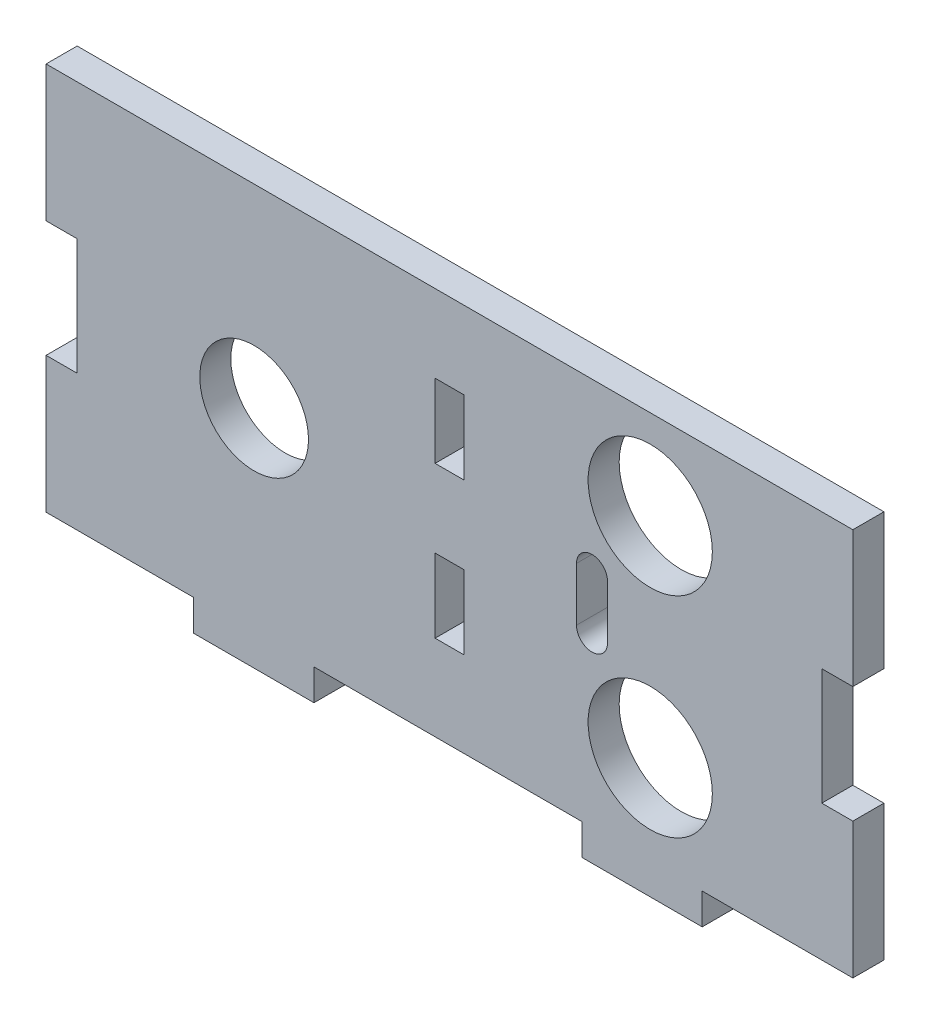
ISO-10303-21;
HEADER;
FILE_DESCRIPTION(('STEP AP214'),'2;1');
FILE_NAME('part.step','',(''),(''),'','','');
FILE_SCHEMA(('AUTOMOTIVE_DESIGN { 1 0 10303 214 1 1 1 1 }'));
ENDSEC;
DATA;
#1=APPLICATION_CONTEXT('core data for automotive mechanical design processes');
#2=APPLICATION_PROTOCOL_DEFINITION('international standard','automotive_design',2000,#1);
#3=PRODUCT_CONTEXT('',#1,'mechanical');
#4=PRODUCT('Part','Part','',(#3));
#5=PRODUCT_RELATED_PRODUCT_CATEGORY('part','',(#4));
#6=PRODUCT_DEFINITION_FORMATION('','',#4);
#7=PRODUCT_DEFINITION_CONTEXT('part definition',#1,'design');
#8=PRODUCT_DEFINITION('design','',#6,#7);
#9=PRODUCT_DEFINITION_SHAPE('','',#8);
#10=(LENGTH_UNIT() NAMED_UNIT(*) SI_UNIT(.MILLI.,.METRE.));
#11=(NAMED_UNIT(*) PLANE_ANGLE_UNIT() SI_UNIT($,.RADIAN.));
#12=(NAMED_UNIT(*) SI_UNIT($,.STERADIAN.) SOLID_ANGLE_UNIT());
#13=UNCERTAINTY_MEASURE_WITH_UNIT(LENGTH_MEASURE(1.E-05),#10,'distance_accuracy_value','');
#14=(GEOMETRIC_REPRESENTATION_CONTEXT(3) GLOBAL_UNCERTAINTY_ASSIGNED_CONTEXT((#13)) GLOBAL_UNIT_ASSIGNED_CONTEXT((#10,
#11,#12)) REPRESENTATION_CONTEXT('',''));
#15=CARTESIAN_POINT('',(0.,0.,0.));
#16=DIRECTION('',(0.,0.,1.));
#17=DIRECTION('',(1.,0.,0.));
#18=AXIS2_PLACEMENT_3D('',#15,#16,#17);
#19=CARTESIAN_POINT('',(0.,0.,4.));
#20=DIRECTION('',(0.,1.,0.));
#21=DIRECTION('',(0.,0.,1.));
#22=AXIS2_PLACEMENT_3D('',#19,#20,#21);
#23=PLANE('',#22);
#24=DIRECTION('',(0.,0.,1.));
#25=VECTOR('',#24,1.);
#26=CARTESIAN_POINT('',(151.95,0.,-0.00100000000000013));
#27=LINE('',#26,#25);
#28=CARTESIAN_POINT('',(151.95,0.,0.));
#29=VERTEX_POINT('',#28);
#30=CARTESIAN_POINT('',(151.95,0.,4.));
#31=VERTEX_POINT('',#30);
#32=EDGE_CURVE('E293',#29,#31,#27,.T.);
#33=ORIENTED_EDGE('',*,*,#32,.T.);
#34=DIRECTION('',(1.,0.,0.));
#35=VECTOR('',#34,1.);
#36=CARTESIAN_POINT('',(0.,0.,4.));
#37=LINE('',#36,#35);
#38=CARTESIAN_POINT('',(132.55,0.,4.));
#39=VERTEX_POINT('',#38);
#40=EDGE_CURVE('E493',#39,#31,#37,.T.);
#41=ORIENTED_EDGE('',*,*,#40,.F.);
#42=DIRECTION('',(0.,0.,1.));
#43=VECTOR('',#42,1.);
#44=CARTESIAN_POINT('',(132.55,0.,0.));
#45=LINE('',#44,#43);
#46=CARTESIAN_POINT('',(132.55,0.,0.));
#47=VERTEX_POINT('',#46);
#48=EDGE_CURVE('E473',#47,#39,#45,.T.);
#49=ORIENTED_EDGE('',*,*,#48,.F.);
#50=DIRECTION('',(1.,0.,0.));
#51=VECTOR('',#50,1.);
#52=CARTESIAN_POINT('',(0.,0.,0.));
#53=LINE('',#52,#51);
#54=EDGE_CURVE('E491',#47,#29,#53,.T.);
#55=ORIENTED_EDGE('',*,*,#54,.T.);
#56=EDGE_LOOP('',(#33,#41,#49,#55));
#57=FACE_BOUND('',#56,.T.);
#58=ADVANCED_FACE('F33',(#57),#23,.F.);
#59=CARTESIAN_POINT('',(0.,50.,4.));
#60=DIRECTION('',(0.,-1.,0.));
#61=DIRECTION('',(0.,0.,-1.));
#62=AXIS2_PLACEMENT_3D('',#59,#60,#61);
#63=PLANE('',#62);
#64=DIRECTION('',(0.,0.,-1.));
#65=VECTOR('',#64,1.);
#66=CARTESIAN_POINT('',(151.95,50.,-0.00100000000000013));
#67=LINE('',#66,#65);
#68=CARTESIAN_POINT('',(151.95,50.,4.));
#69=VERTEX_POINT('',#68);
#70=CARTESIAN_POINT('',(151.95,50.,0.));
#71=VERTEX_POINT('',#70);
#72=EDGE_CURVE('E286',#69,#71,#67,.T.);
#73=ORIENTED_EDGE('',*,*,#72,.T.);
#74=DIRECTION('',(-1.,0.,0.));
#75=VECTOR('',#74,1.);
#76=CARTESIAN_POINT('',(0.,50.,0.));
#77=LINE('',#76,#75);
#78=CARTESIAN_POINT('',(48.05,50.,0.));
#79=VERTEX_POINT('',#78);
#80=EDGE_CURVE('E36',#71,#79,#77,.T.);
#81=ORIENTED_EDGE('',*,*,#80,.T.);
#82=DIRECTION('',(0.,0.,-1.));
#83=VECTOR('',#82,1.);
#84=CARTESIAN_POINT('',(48.05,50.,-0.00100000000000013));
#85=LINE('',#84,#83);
#86=CARTESIAN_POINT('',(48.05,50.,4.));
#87=VERTEX_POINT('',#86);
#88=EDGE_CURVE('E330',#87,#79,#85,.T.);
#89=ORIENTED_EDGE('',*,*,#88,.F.);
#90=DIRECTION('',(-1.,0.,0.));
#91=VECTOR('',#90,1.);
#92=CARTESIAN_POINT('',(0.,50.,4.));
#93=LINE('',#92,#91);
#94=EDGE_CURVE('E11',#69,#87,#93,.T.);
#95=ORIENTED_EDGE('',*,*,#94,.F.);
#96=EDGE_LOOP('',(#73,#81,#89,#95));
#97=FACE_BOUND('',#96,.T.);
#98=ADVANCED_FACE('F544',(#97),#63,.F.);
#99=CARTESIAN_POINT('',(0.,0.,4.));
#100=DIRECTION('',(0.,0.,-1.));
#101=DIRECTION('',(-1.,0.,0.));
#102=AXIS2_PLACEMENT_3D('',#99,#100,#101);
#103=PLANE('',#102);
#104=CARTESIAN_POINT('',(74.842197301848,25.,4.));
#105=DIRECTION('',(0.,0.,1.));
#106=DIRECTION('',(1.,0.,0.));
#107=AXIS2_PLACEMENT_3D('',#104,#105,#106);
#108=CIRCLE('',#107,7.);
#109=CARTESIAN_POINT('',(81.842197301848,25.,4.));
#110=VERTEX_POINT('',#109);
#111=EDGE_CURVE('E277',#110,#110,#108,.T.);
#112=ORIENTED_EDGE('',*,*,#111,.F.);
#113=EDGE_LOOP('',(#112));
#114=FACE_BOUND('',#113,.T.);
#115=DIRECTION('',(0.,-1.,0.));
#116=VECTOR('',#115,1.);
#117=CARTESIAN_POINT('',(116.354935265181,28.4489639727675,4.));
#118=LINE('',#117,#116);
#119=CARTESIAN_POINT('',(116.354935265181,28.4489639727675,4.));
#120=VERTEX_POINT('',#119);
#121=CARTESIAN_POINT('',(116.354935265181,21.5510360272325,4.));
#122=VERTEX_POINT('',#121);
#123=EDGE_CURVE('E261',#120,#122,#118,.T.);
#124=ORIENTED_EDGE('',*,*,#123,.F.);
#125=CARTESIAN_POINT('',(118.354935265181,28.4489639727675,4.));
#126=DIRECTION('',(0.,0.,1.));
#127=DIRECTION('',(1.,0.,0.));
#128=AXIS2_PLACEMENT_3D('',#125,#126,#127);
#129=CIRCLE('',#128,2.00000000000002);
#130=CARTESIAN_POINT('',(120.354935265181,28.4489639727675,4.));
#131=VERTEX_POINT('',#130);
#132=EDGE_CURVE('E49',#131,#120,#129,.T.);
#133=ORIENTED_EDGE('',*,*,#132,.F.);
#134=DIRECTION('',(0.,1.,0.));
#135=VECTOR('',#134,1.);
#136=CARTESIAN_POINT('',(120.354935265181,28.4489639727675,4.));
#137=LINE('',#136,#135);
#138=CARTESIAN_POINT('',(120.354935265181,21.5510360272325,4.));
#139=VERTEX_POINT('',#138);
#140=EDGE_CURVE('E254',#139,#131,#137,.T.);
#141=ORIENTED_EDGE('',*,*,#140,.F.);
#142=CARTESIAN_POINT('',(118.354935265181,21.5510360272325,4.));
#143=DIRECTION('',(0.,0.,1.));
#144=DIRECTION('',(1.,0.,0.));
#145=AXIS2_PLACEMENT_3D('',#142,#143,#144);
#146=CIRCLE('',#145,2.00000000000002);
#147=EDGE_CURVE('E268',#122,#139,#146,.T.);
#148=ORIENTED_EDGE('',*,*,#147,.F.);
#149=EDGE_LOOP('',(#124,#133,#141,#148));
#150=FACE_BOUND('',#149,.T.);
#151=CARTESIAN_POINT('',(125.855537029281,38.5,4.));
#152=DIRECTION('',(0.,0.,1.));
#153=DIRECTION('',(1.,0.,0.));
#154=AXIS2_PLACEMENT_3D('',#151,#152,#153);
#155=CIRCLE('',#154,8.00000000000001);
#156=CARTESIAN_POINT('',(133.855537029281,38.5,4.));
#157=VERTEX_POINT('',#156);
#158=EDGE_CURVE('E290',#157,#157,#155,.T.);
#159=ORIENTED_EDGE('',*,*,#158,.F.);
#160=EDGE_LOOP('',(#159));
#161=FACE_BOUND('',#160,.T.);
#162=CARTESIAN_POINT('',(125.855537029281,11.5,4.));
#163=DIRECTION('',(0.,0.,1.));
#164=DIRECTION('',(1.,0.,0.));
#165=AXIS2_PLACEMENT_3D('',#162,#163,#164);
#166=CIRCLE('',#165,8.00000000000001);
#167=CARTESIAN_POINT('',(133.855537029281,11.5,4.));
#168=VERTEX_POINT('',#167);
#169=EDGE_CURVE('E283',#168,#168,#166,.T.);
#170=ORIENTED_EDGE('',*,*,#169,.F.);
#171=EDGE_LOOP('',(#170));
#172=FACE_BOUND('',#171,.T.);
#173=DIRECTION('',(-1.,0.,0.));
#174=VECTOR('',#173,1.);
#175=CARTESIAN_POINT('',(101.85,20.5,4.));
#176=LINE('',#175,#174);
#177=CARTESIAN_POINT('',(101.85,20.5,4.));
#178=VERTEX_POINT('',#177);
#179=CARTESIAN_POINT('',(98.15,20.5,4.));
#180=VERTEX_POINT('',#179);
#181=EDGE_CURVE('E408',#178,#180,#176,.T.);
#182=ORIENTED_EDGE('',*,*,#181,.F.);
#183=DIRECTION('',(0.,1.,0.));
#184=VECTOR('',#183,1.);
#185=CARTESIAN_POINT('',(101.85,20.5,4.));
#186=LINE('',#185,#184);
#187=CARTESIAN_POINT('',(101.85,11.,4.));
#188=VERTEX_POINT('',#187);
#189=EDGE_CURVE('E411',#188,#178,#186,.T.);
#190=ORIENTED_EDGE('',*,*,#189,.F.);
#191=DIRECTION('',(1.,0.,0.));
#192=VECTOR('',#191,1.);
#193=CARTESIAN_POINT('',(101.85,11.,4.));
#194=LINE('',#193,#192);
#195=CARTESIAN_POINT('',(98.15,11.,4.));
#196=VERTEX_POINT('',#195);
#197=EDGE_CURVE('E377',#196,#188,#194,.T.);
#198=ORIENTED_EDGE('',*,*,#197,.F.);
#199=DIRECTION('',(0.,-1.,0.));
#200=VECTOR('',#199,1.);
#201=CARTESIAN_POINT('',(98.15,20.5,4.));
#202=LINE('',#201,#200);
#203=EDGE_CURVE('E373',#180,#196,#202,.T.);
#204=ORIENTED_EDGE('',*,*,#203,.F.);
#205=EDGE_LOOP('',(#182,#190,#198,#204));
#206=FACE_BOUND('',#205,.T.);
#207=DIRECTION('',(0.,1.,0.));
#208=VECTOR('',#207,1.);
#209=CARTESIAN_POINT('',(101.85,40.,4.));
#210=LINE('',#209,#208);
#211=CARTESIAN_POINT('',(101.85,30.5,4.));
#212=VERTEX_POINT('',#211);
#213=CARTESIAN_POINT('',(101.85,40.,4.));
#214=VERTEX_POINT('',#213);
#215=EDGE_CURVE('E376',#212,#214,#210,.T.);
#216=ORIENTED_EDGE('',*,*,#215,.F.);
#217=DIRECTION('',(1.,0.,0.));
#218=VECTOR('',#217,1.);
#219=CARTESIAN_POINT('',(101.85,30.5,4.));
#220=LINE('',#219,#218);
#221=CARTESIAN_POINT('',(98.15,30.5,4.));
#222=VERTEX_POINT('',#221);
#223=EDGE_CURVE('E380',#222,#212,#220,.T.);
#224=ORIENTED_EDGE('',*,*,#223,.F.);
#225=DIRECTION('',(0.,-1.,0.));
#226=VECTOR('',#225,1.);
#227=CARTESIAN_POINT('',(98.15,30.5,4.));
#228=LINE('',#227,#226);
#229=CARTESIAN_POINT('',(98.15,40.,4.));
#230=VERTEX_POINT('',#229);
#231=EDGE_CURVE('E397',#230,#222,#228,.T.);
#232=ORIENTED_EDGE('',*,*,#231,.F.);
#233=DIRECTION('',(-1.,0.,0.));
#234=VECTOR('',#233,1.);
#235=CARTESIAN_POINT('',(98.15,40.,4.));
#236=LINE('',#235,#234);
#237=EDGE_CURVE('E374',#214,#230,#236,.T.);
#238=ORIENTED_EDGE('',*,*,#237,.F.);
#239=EDGE_LOOP('',(#216,#224,#232,#238));
#240=FACE_BOUND('',#239,.T.);
#241=DIRECTION('',(0.,1.,0.));
#242=VECTOR('',#241,1.);
#243=CARTESIAN_POINT('',(151.95,17.5,4.));
#244=LINE('',#243,#242);
#245=CARTESIAN_POINT('',(151.95,17.5,4.));
#246=VERTEX_POINT('',#245);
#247=EDGE_CURVE('E317',#31,#246,#244,.T.);
#248=ORIENTED_EDGE('',*,*,#247,.T.);
#249=DIRECTION('',(-1.,0.,0.));
#250=VECTOR('',#249,1.);
#251=CARTESIAN_POINT('',(151.95,17.5,4.));
#252=LINE('',#251,#250);
#253=CARTESIAN_POINT('',(147.95,17.5,4.));
#254=VERTEX_POINT('',#253);
#255=EDGE_CURVE('E314',#246,#254,#252,.T.);
#256=ORIENTED_EDGE('',*,*,#255,.T.);
#257=DIRECTION('',(0.,1.,0.));
#258=VECTOR('',#257,1.);
#259=CARTESIAN_POINT('',(147.95,17.5,4.));
#260=LINE('',#259,#258);
#261=CARTESIAN_POINT('',(147.95,32.5,4.));
#262=VERTEX_POINT('',#261);
#263=EDGE_CURVE('E311',#254,#262,#260,.T.);
#264=ORIENTED_EDGE('',*,*,#263,.T.);
#265=DIRECTION('',(1.,0.,0.));
#266=VECTOR('',#265,1.);
#267=CARTESIAN_POINT('',(147.95,32.5,4.));
#268=LINE('',#267,#266);
#269=CARTESIAN_POINT('',(151.95,32.5,4.));
#270=VERTEX_POINT('',#269);
#271=EDGE_CURVE('E308',#262,#270,#268,.T.);
#272=ORIENTED_EDGE('',*,*,#271,.T.);
#273=DIRECTION('',(0.,1.,0.));
#274=VECTOR('',#273,1.);
#275=CARTESIAN_POINT('',(151.95,32.5,4.));
#276=LINE('',#275,#274);
#277=EDGE_CURVE('E305',#270,#69,#276,.T.);
#278=ORIENTED_EDGE('',*,*,#277,.T.);
#279=ORIENTED_EDGE('',*,*,#94,.T.);
#280=DIRECTION('',(0.,1.,0.));
#281=VECTOR('',#280,1.);
#282=CARTESIAN_POINT('',(48.05,32.5,4.));
#283=LINE('',#282,#281);
#284=CARTESIAN_POINT('',(48.05,32.5,4.));
#285=VERTEX_POINT('',#284);
#286=EDGE_CURVE('E359',#285,#87,#283,.T.);
#287=ORIENTED_EDGE('',*,*,#286,.F.);
#288=DIRECTION('',(-1.,0.,0.));
#289=VECTOR('',#288,1.);
#290=CARTESIAN_POINT('',(52.05,32.5,4.));
#291=LINE('',#290,#289);
#292=CARTESIAN_POINT('',(52.05,32.5,4.));
#293=VERTEX_POINT('',#292);
#294=EDGE_CURVE('E356',#293,#285,#291,.T.);
#295=ORIENTED_EDGE('',*,*,#294,.F.);
#296=DIRECTION('',(0.,1.,0.));
#297=VECTOR('',#296,1.);
#298=CARTESIAN_POINT('',(52.05,17.5,4.));
#299=LINE('',#298,#297);
#300=CARTESIAN_POINT('',(52.05,17.5,4.));
#301=VERTEX_POINT('',#300);
#302=EDGE_CURVE('E353',#301,#293,#299,.T.);
#303=ORIENTED_EDGE('',*,*,#302,.F.);
#304=DIRECTION('',(1.,0.,0.));
#305=VECTOR('',#304,1.);
#306=CARTESIAN_POINT('',(48.05,17.5,4.));
#307=LINE('',#306,#305);
#308=CARTESIAN_POINT('',(48.05,17.5,4.));
#309=VERTEX_POINT('',#308);
#310=EDGE_CURVE('E350',#309,#301,#307,.T.);
#311=ORIENTED_EDGE('',*,*,#310,.F.);
#312=DIRECTION('',(0.,1.,0.));
#313=VECTOR('',#312,1.);
#314=CARTESIAN_POINT('',(48.05,17.5,4.));
#315=LINE('',#314,#313);
#316=CARTESIAN_POINT('',(48.05,0.,4.));
#317=VERTEX_POINT('',#316);
#318=EDGE_CURVE('E347',#317,#309,#315,.T.);
#319=ORIENTED_EDGE('',*,*,#318,.F.);
#320=CARTESIAN_POINT('',(67.05,0.,4.));
#321=VERTEX_POINT('',#320);
#322=EDGE_CURVE('E41',#317,#321,#37,.T.);
#323=ORIENTED_EDGE('',*,*,#322,.T.);
#324=DIRECTION('',(0.,1.,0.));
#325=VECTOR('',#324,1.);
#326=CARTESIAN_POINT('',(67.05,0.,4.));
#327=LINE('',#326,#325);
#328=CARTESIAN_POINT('',(67.05,-4.,4.));
#329=VERTEX_POINT('',#328);
#330=EDGE_CURVE('E440',#329,#321,#327,.T.);
#331=ORIENTED_EDGE('',*,*,#330,.F.);
#332=DIRECTION('',(-1.,0.,0.));
#333=VECTOR('',#332,1.);
#334=CARTESIAN_POINT('',(82.55,-4.,4.));
#335=LINE('',#334,#333);
#336=CARTESIAN_POINT('',(82.55,-4.,4.));
#337=VERTEX_POINT('',#336);
#338=EDGE_CURVE('E448',#337,#329,#335,.T.);
#339=ORIENTED_EDGE('',*,*,#338,.F.);
#340=DIRECTION('',(0.,-1.,0.));
#341=VECTOR('',#340,1.);
#342=CARTESIAN_POINT('',(82.55,0.,4.));
#343=LINE('',#342,#341);
#344=CARTESIAN_POINT('',(82.55,0.,4.));
#345=VERTEX_POINT('',#344);
#346=EDGE_CURVE('E406',#345,#337,#343,.T.);
#347=ORIENTED_EDGE('',*,*,#346,.F.);
#348=CARTESIAN_POINT('',(117.05,0.,4.));
#349=VERTEX_POINT('',#348);
#350=EDGE_CURVE('E492',#345,#349,#37,.T.);
#351=ORIENTED_EDGE('',*,*,#350,.T.);
#352=DIRECTION('',(0.,1.,0.));
#353=VECTOR('',#352,1.);
#354=CARTESIAN_POINT('',(117.05,0.,4.));
#355=LINE('',#354,#353);
#356=CARTESIAN_POINT('',(117.05,-4.,4.));
#357=VERTEX_POINT('',#356);
#358=EDGE_CURVE('E468',#357,#349,#355,.T.);
#359=ORIENTED_EDGE('',*,*,#358,.F.);
#360=DIRECTION('',(-1.,0.,0.));
#361=VECTOR('',#360,1.);
#362=CARTESIAN_POINT('',(132.55,-4.,4.));
#363=LINE('',#362,#361);
#364=CARTESIAN_POINT('',(132.55,-4.,4.));
#365=VERTEX_POINT('',#364);
#366=EDGE_CURVE('E476',#365,#357,#363,.T.);
#367=ORIENTED_EDGE('',*,*,#366,.F.);
#368=DIRECTION('',(0.,-1.,0.));
#369=VECTOR('',#368,1.);
#370=CARTESIAN_POINT('',(132.55,0.,4.));
#371=LINE('',#370,#369);
#372=EDGE_CURVE('E463',#39,#365,#371,.T.);
#373=ORIENTED_EDGE('',*,*,#372,.F.);
#374=ORIENTED_EDGE('',*,*,#40,.T.);
#375=EDGE_LOOP('',(#248,#256,#264,#272,#278,#279,#287,#295,#303,#311,#319,#323,#331,#339,#347,
#351,#359,#367,#373,#374));
#376=FACE_BOUND('',#375,.T.);
#377=ADVANCED_FACE('F518',(#114,#150,#161,#172,#206,#240,#376),#103,.F.);
#378=CARTESIAN_POINT('',(0.,0.,0.));
#379=DIRECTION('',(0.,0.,-1.));
#380=DIRECTION('',(-1.,0.,0.));
#381=AXIS2_PLACEMENT_3D('',#378,#379,#380);
#382=PLANE('',#381);
#383=CARTESIAN_POINT('',(74.842197301848,25.,0.));
#384=DIRECTION('',(0.,0.,-1.));
#385=DIRECTION('',(-1.,0.,0.));
#386=AXIS2_PLACEMENT_3D('',#383,#384,#385);
#387=CIRCLE('',#386,7.);
#388=CARTESIAN_POINT('',(67.842197301848,25.,0.));
#389=VERTEX_POINT('',#388);
#390=EDGE_CURVE('E280',#389,#389,#387,.F.);
#391=ORIENTED_EDGE('',*,*,#390,.T.);
#392=EDGE_LOOP('',(#391));
#393=FACE_BOUND('',#392,.T.);
#394=CARTESIAN_POINT('',(118.354935265181,28.4489639727675,0.));
#395=DIRECTION('',(0.,0.,-1.));
#396=DIRECTION('',(-1.,0.,0.));
#397=AXIS2_PLACEMENT_3D('',#394,#395,#396);
#398=CIRCLE('',#397,2.00000000000002);
#399=CARTESIAN_POINT('',(120.354935265181,28.4489639727675,0.));
#400=VERTEX_POINT('',#399);
#401=CARTESIAN_POINT('',(116.354935265181,28.4489639727675,0.));
#402=VERTEX_POINT('',#401);
#403=EDGE_CURVE('E252',#400,#402,#398,.F.);
#404=ORIENTED_EDGE('',*,*,#403,.T.);
#405=DIRECTION('',(0.,-1.,0.));
#406=VECTOR('',#405,1.);
#407=CARTESIAN_POINT('',(116.354935265181,28.4489639727675,0.));
#408=LINE('',#407,#406);
#409=CARTESIAN_POINT('',(116.354935265181,21.5510360272325,0.));
#410=VERTEX_POINT('',#409);
#411=EDGE_CURVE('E241',#402,#410,#408,.T.);
#412=ORIENTED_EDGE('',*,*,#411,.T.);
#413=CARTESIAN_POINT('',(118.354935265181,21.5510360272325,0.));
#414=DIRECTION('',(0.,0.,-1.));
#415=DIRECTION('',(-1.,0.,0.));
#416=AXIS2_PLACEMENT_3D('',#413,#414,#415);
#417=CIRCLE('',#416,2.00000000000002);
#418=CARTESIAN_POINT('',(120.354935265181,21.5510360272325,0.));
#419=VERTEX_POINT('',#418);
#420=EDGE_CURVE('E263',#410,#419,#417,.F.);
#421=ORIENTED_EDGE('',*,*,#420,.T.);
#422=DIRECTION('',(0.,1.,0.));
#423=VECTOR('',#422,1.);
#424=CARTESIAN_POINT('',(120.354935265181,28.4489639727675,0.));
#425=LINE('',#424,#423);
#426=EDGE_CURVE('E259',#419,#400,#425,.T.);
#427=ORIENTED_EDGE('',*,*,#426,.T.);
#428=EDGE_LOOP('',(#404,#412,#421,#427));
#429=FACE_BOUND('',#428,.T.);
#430=CARTESIAN_POINT('',(125.855537029281,38.5,0.));
#431=DIRECTION('',(0.,0.,-1.));
#432=DIRECTION('',(-1.,0.,0.));
#433=AXIS2_PLACEMENT_3D('',#430,#431,#432);
#434=CIRCLE('',#433,8.00000000000001);
#435=CARTESIAN_POINT('',(117.855537029281,38.5,0.));
#436=VERTEX_POINT('',#435);
#437=EDGE_CURVE('E248',#436,#436,#434,.F.);
#438=ORIENTED_EDGE('',*,*,#437,.T.);
#439=EDGE_LOOP('',(#438));
#440=FACE_BOUND('',#439,.T.);
#441=CARTESIAN_POINT('',(125.855537029281,11.5,0.));
#442=DIRECTION('',(0.,0.,-1.));
#443=DIRECTION('',(-1.,0.,0.));
#444=AXIS2_PLACEMENT_3D('',#441,#442,#443);
#445=CIRCLE('',#444,8.00000000000001);
#446=CARTESIAN_POINT('',(117.855537029281,11.5,0.));
#447=VERTEX_POINT('',#446);
#448=EDGE_CURVE('E287',#447,#447,#445,.F.);
#449=ORIENTED_EDGE('',*,*,#448,.T.);
#450=EDGE_LOOP('',(#449));
#451=FACE_BOUND('',#450,.T.);
#452=DIRECTION('',(-1.,0.,0.));
#453=VECTOR('',#452,1.);
#454=CARTESIAN_POINT('',(101.85,30.5,0.));
#455=LINE('',#454,#453);
#456=CARTESIAN_POINT('',(101.85,30.5,0.));
#457=VERTEX_POINT('',#456);
#458=CARTESIAN_POINT('',(98.15,30.5,0.));
#459=VERTEX_POINT('',#458);
#460=EDGE_CURVE('E383',#457,#459,#455,.T.);
#461=ORIENTED_EDGE('',*,*,#460,.F.);
#462=DIRECTION('',(0.,-1.,0.));
#463=VECTOR('',#462,1.);
#464=CARTESIAN_POINT('',(101.85,40.,0.));
#465=LINE('',#464,#463);
#466=CARTESIAN_POINT('',(101.85,40.,0.));
#467=VERTEX_POINT('',#466);
#468=EDGE_CURVE('E391',#467,#457,#465,.T.);
#469=ORIENTED_EDGE('',*,*,#468,.F.);
#470=DIRECTION('',(1.,0.,0.));
#471=VECTOR('',#470,1.);
#472=CARTESIAN_POINT('',(98.15,40.,0.));
#473=LINE('',#472,#471);
#474=CARTESIAN_POINT('',(98.15,40.,0.));
#475=VERTEX_POINT('',#474);
#476=EDGE_CURVE('E388',#475,#467,#473,.T.);
#477=ORIENTED_EDGE('',*,*,#476,.F.);
#478=DIRECTION('',(0.,1.,0.));
#479=VECTOR('',#478,1.);
#480=CARTESIAN_POINT('',(98.15,30.5,0.));
#481=LINE('',#480,#479);
#482=EDGE_CURVE('E385',#459,#475,#481,.T.);
#483=ORIENTED_EDGE('',*,*,#482,.F.);
#484=EDGE_LOOP('',(#461,#469,#477,#483));
#485=FACE_BOUND('',#484,.T.);
#486=DIRECTION('',(0.,-1.,0.));
#487=VECTOR('',#486,1.);
#488=CARTESIAN_POINT('',(101.85,20.5,0.));
#489=LINE('',#488,#487);
#490=CARTESIAN_POINT('',(101.85,20.5,0.));
#491=VERTEX_POINT('',#490);
#492=CARTESIAN_POINT('',(101.85,11.,0.));
#493=VERTEX_POINT('',#492);
#494=EDGE_CURVE('E414',#491,#493,#489,.T.);
#495=ORIENTED_EDGE('',*,*,#494,.F.);
#496=DIRECTION('',(1.,0.,0.));
#497=VECTOR('',#496,1.);
#498=CARTESIAN_POINT('',(101.85,20.5,0.));
#499=LINE('',#498,#497);
#500=CARTESIAN_POINT('',(98.15,20.5,0.));
#501=VERTEX_POINT('',#500);
#502=EDGE_CURVE('E422',#501,#491,#499,.T.);
#503=ORIENTED_EDGE('',*,*,#502,.F.);
#504=DIRECTION('',(0.,1.,0.));
#505=VECTOR('',#504,1.);
#506=CARTESIAN_POINT('',(98.15,20.5,0.));
#507=LINE('',#506,#505);
#508=CARTESIAN_POINT('',(98.15,11.,0.));
#509=VERTEX_POINT('',#508);
#510=EDGE_CURVE('E419',#509,#501,#507,.T.);
#511=ORIENTED_EDGE('',*,*,#510,.F.);
#512=DIRECTION('',(-1.,0.,0.));
#513=VECTOR('',#512,1.);
#514=CARTESIAN_POINT('',(101.85,11.,0.));
#515=LINE('',#514,#513);
#516=EDGE_CURVE('E416',#493,#509,#515,.T.);
#517=ORIENTED_EDGE('',*,*,#516,.F.);
#518=EDGE_LOOP('',(#495,#503,#511,#517));
#519=FACE_BOUND('',#518,.T.);
#520=DIRECTION('',(-1.,0.,0.));
#521=VECTOR('',#520,1.);
#522=CARTESIAN_POINT('',(151.95,17.5,0.));
#523=LINE('',#522,#521);
#524=CARTESIAN_POINT('',(151.95,17.5,0.));
#525=VERTEX_POINT('',#524);
#526=CARTESIAN_POINT('',(147.95,17.5,0.));
#527=VERTEX_POINT('',#526);
#528=EDGE_CURVE('E301',#525,#527,#523,.T.);
#529=ORIENTED_EDGE('',*,*,#528,.F.);
#530=DIRECTION('',(0.,1.,0.));
#531=VECTOR('',#530,1.);
#532=CARTESIAN_POINT('',(151.95,17.5,0.));
#533=LINE('',#532,#531);
#534=EDGE_CURVE('E303',#29,#525,#533,.T.);
#535=ORIENTED_EDGE('',*,*,#534,.F.);
#536=ORIENTED_EDGE('',*,*,#54,.F.);
#537=DIRECTION('',(0.,-1.,0.));
#538=VECTOR('',#537,1.);
#539=CARTESIAN_POINT('',(132.55,0.,0.));
#540=LINE('',#539,#538);
#541=CARTESIAN_POINT('',(132.55,-4.,0.));
#542=VERTEX_POINT('',#541);
#543=EDGE_CURVE('E464',#47,#542,#540,.T.);
#544=ORIENTED_EDGE('',*,*,#543,.T.);
#545=DIRECTION('',(-1.,0.,0.));
#546=VECTOR('',#545,1.);
#547=CARTESIAN_POINT('',(132.55,-4.,0.));
#548=LINE('',#547,#546);
#549=CARTESIAN_POINT('',(117.05,-4.,0.));
#550=VERTEX_POINT('',#549);
#551=EDGE_CURVE('E467',#542,#550,#548,.T.);
#552=ORIENTED_EDGE('',*,*,#551,.T.);
#553=DIRECTION('',(0.,1.,0.));
#554=VECTOR('',#553,1.);
#555=CARTESIAN_POINT('',(117.05,0.,0.));
#556=LINE('',#555,#554);
#557=CARTESIAN_POINT('',(117.05,0.,0.));
#558=VERTEX_POINT('',#557);
#559=EDGE_CURVE('E470',#550,#558,#556,.T.);
#560=ORIENTED_EDGE('',*,*,#559,.T.);
#561=CARTESIAN_POINT('',(82.55,0.,0.));
#562=VERTEX_POINT('',#561);
#563=EDGE_CURVE('E495',#562,#558,#53,.T.);
#564=ORIENTED_EDGE('',*,*,#563,.F.);
#565=DIRECTION('',(0.,-1.,0.));
#566=VECTOR('',#565,1.);
#567=CARTESIAN_POINT('',(82.55,0.,0.));
#568=LINE('',#567,#566);
#569=CARTESIAN_POINT('',(82.55,-4.,0.));
#570=VERTEX_POINT('',#569);
#571=EDGE_CURVE('E436',#562,#570,#568,.T.);
#572=ORIENTED_EDGE('',*,*,#571,.T.);
#573=DIRECTION('',(-1.,0.,0.));
#574=VECTOR('',#573,1.);
#575=CARTESIAN_POINT('',(82.55,-4.,0.));
#576=LINE('',#575,#574);
#577=CARTESIAN_POINT('',(67.05,-4.,0.));
#578=VERTEX_POINT('',#577);
#579=EDGE_CURVE('E439',#570,#578,#576,.T.);
#580=ORIENTED_EDGE('',*,*,#579,.T.);
#581=DIRECTION('',(0.,1.,0.));
#582=VECTOR('',#581,1.);
#583=CARTESIAN_POINT('',(67.05,0.,0.));
#584=LINE('',#583,#582);
#585=CARTESIAN_POINT('',(67.05,0.,0.));
#586=VERTEX_POINT('',#585);
#587=EDGE_CURVE('E442',#578,#586,#584,.T.);
#588=ORIENTED_EDGE('',*,*,#587,.T.);
#589=CARTESIAN_POINT('',(48.05,0.,0.));
#590=VERTEX_POINT('',#589);
#591=EDGE_CURVE('E494',#590,#586,#53,.T.);
#592=ORIENTED_EDGE('',*,*,#591,.F.);
#593=DIRECTION('',(0.,1.,0.));
#594=VECTOR('',#593,1.);
#595=CARTESIAN_POINT('',(48.05,17.5,0.));
#596=LINE('',#595,#594);
#597=CARTESIAN_POINT('',(48.05,17.5,0.));
#598=VERTEX_POINT('',#597);
#599=EDGE_CURVE('E365',#590,#598,#596,.T.);
#600=ORIENTED_EDGE('',*,*,#599,.T.);
#601=DIRECTION('',(1.,0.,0.));
#602=VECTOR('',#601,1.);
#603=CARTESIAN_POINT('',(48.05,17.5,0.));
#604=LINE('',#603,#602);
#605=CARTESIAN_POINT('',(52.05,17.5,0.));
#606=VERTEX_POINT('',#605);
#607=EDGE_CURVE('E335',#598,#606,#604,.T.);
#608=ORIENTED_EDGE('',*,*,#607,.T.);
#609=DIRECTION('',(0.,1.,0.));
#610=VECTOR('',#609,1.);
#611=CARTESIAN_POINT('',(52.05,17.5,0.));
#612=LINE('',#611,#610);
#613=CARTESIAN_POINT('',(52.05,32.5,0.));
#614=VERTEX_POINT('',#613);
#615=EDGE_CURVE('E338',#606,#614,#612,.T.);
#616=ORIENTED_EDGE('',*,*,#615,.T.);
#617=DIRECTION('',(-1.,0.,0.));
#618=VECTOR('',#617,1.);
#619=CARTESIAN_POINT('',(52.05,32.5,0.));
#620=LINE('',#619,#618);
#621=CARTESIAN_POINT('',(48.05,32.5,0.));
#622=VERTEX_POINT('',#621);
#623=EDGE_CURVE('E341',#614,#622,#620,.T.);
#624=ORIENTED_EDGE('',*,*,#623,.T.);
#625=DIRECTION('',(0.,1.,0.));
#626=VECTOR('',#625,1.);
#627=CARTESIAN_POINT('',(48.05,32.5,0.));
#628=LINE('',#627,#626);
#629=EDGE_CURVE('E344',#622,#79,#628,.T.);
#630=ORIENTED_EDGE('',*,*,#629,.T.);
#631=ORIENTED_EDGE('',*,*,#80,.F.);
#632=DIRECTION('',(0.,1.,0.));
#633=VECTOR('',#632,1.);
#634=CARTESIAN_POINT('',(151.95,32.5,0.));
#635=LINE('',#634,#633);
#636=CARTESIAN_POINT('',(151.95,32.5,0.));
#637=VERTEX_POINT('',#636);
#638=EDGE_CURVE('E323',#637,#71,#635,.T.);
#639=ORIENTED_EDGE('',*,*,#638,.F.);
#640=DIRECTION('',(1.,0.,0.));
#641=VECTOR('',#640,1.);
#642=CARTESIAN_POINT('',(147.95,32.5,0.));
#643=LINE('',#642,#641);
#644=CARTESIAN_POINT('',(147.95,32.5,0.));
#645=VERTEX_POINT('',#644);
#646=EDGE_CURVE('E296',#645,#637,#643,.T.);
#647=ORIENTED_EDGE('',*,*,#646,.F.);
#648=DIRECTION('',(0.,1.,0.));
#649=VECTOR('',#648,1.);
#650=CARTESIAN_POINT('',(147.95,17.5,0.));
#651=LINE('',#650,#649);
#652=EDGE_CURVE('E298',#527,#645,#651,.T.);
#653=ORIENTED_EDGE('',*,*,#652,.F.);
#654=EDGE_LOOP('',(#529,#535,#536,#544,#552,#560,#564,#572,#580,#588,#592,#600,#608,#616,#624,
#630,#631,#639,#647,#653));
#655=FACE_BOUND('',#654,.T.);
#656=ADVANCED_FACE('F257',(#393,#429,#440,#451,#485,#519,#655),#382,.T.);
#657=ORIENTED_EDGE('',*,*,#322,.F.);
#658=DIRECTION('',(0.,0.,1.));
#659=VECTOR('',#658,1.);
#660=CARTESIAN_POINT('',(48.05,0.,-0.00100000000000013));
#661=LINE('',#660,#659);
#662=EDGE_CURVE('E333',#590,#317,#661,.T.);
#663=ORIENTED_EDGE('',*,*,#662,.F.);
#664=ORIENTED_EDGE('',*,*,#591,.T.);
#665=DIRECTION('',(0.,0.,1.));
#666=VECTOR('',#665,1.);
#667=CARTESIAN_POINT('',(67.05,0.,0.));
#668=LINE('',#667,#666);
#669=EDGE_CURVE('E454',#586,#321,#668,.T.);
#670=ORIENTED_EDGE('',*,*,#669,.T.);
#671=EDGE_LOOP('',(#657,#663,#664,#670));
#672=FACE_BOUND('',#671,.T.);
#673=ADVANCED_FACE('F541',(#672),#23,.F.);
#674=DIRECTION('',(0.,0.,1.));
#675=VECTOR('',#674,1.);
#676=CARTESIAN_POINT('',(82.55,0.,0.));
#677=LINE('',#676,#675);
#678=EDGE_CURVE('E445',#562,#345,#677,.T.);
#679=ORIENTED_EDGE('',*,*,#678,.F.);
#680=ORIENTED_EDGE('',*,*,#563,.T.);
#681=DIRECTION('',(0.,0.,1.));
#682=VECTOR('',#681,1.);
#683=CARTESIAN_POINT('',(117.05,0.,0.));
#684=LINE('',#683,#682);
#685=EDGE_CURVE('E482',#558,#349,#684,.T.);
#686=ORIENTED_EDGE('',*,*,#685,.T.);
#687=ORIENTED_EDGE('',*,*,#350,.F.);
#688=EDGE_LOOP('',(#679,#680,#686,#687));
#689=FACE_BOUND('',#688,.T.);
#690=ADVANCED_FACE('F525',(#689),#23,.F.);
#691=CARTESIAN_POINT('',(132.55,0.,0.));
#692=DIRECTION('',(-1.,0.,0.));
#693=DIRECTION('',(0.,0.,1.));
#694=AXIS2_PLACEMENT_3D('',#691,#692,#693);
#695=PLANE('',#694);
#696=ORIENTED_EDGE('',*,*,#372,.T.);
#697=DIRECTION('',(0.,0.,1.));
#698=VECTOR('',#697,1.);
#699=CARTESIAN_POINT('',(132.55,-4.,0.));
#700=LINE('',#699,#698);
#701=EDGE_CURVE('E488',#542,#365,#700,.T.);
#702=ORIENTED_EDGE('',*,*,#701,.F.);
#703=ORIENTED_EDGE('',*,*,#543,.F.);
#704=ORIENTED_EDGE('',*,*,#48,.T.);
#705=EDGE_LOOP('',(#696,#702,#703,#704));
#706=FACE_BOUND('',#705,.T.);
#707=ADVANCED_FACE('F533',(#706),#695,.F.);
#708=CARTESIAN_POINT('',(132.55,-4.,0.));
#709=DIRECTION('',(0.,1.,0.));
#710=DIRECTION('',(0.,0.,1.));
#711=AXIS2_PLACEMENT_3D('',#708,#709,#710);
#712=PLANE('',#711);
#713=ORIENTED_EDGE('',*,*,#366,.T.);
#714=DIRECTION('',(0.,0.,1.));
#715=VECTOR('',#714,1.);
#716=CARTESIAN_POINT('',(117.05,-4.,0.));
#717=LINE('',#716,#715);
#718=EDGE_CURVE('E485',#550,#357,#717,.T.);
#719=ORIENTED_EDGE('',*,*,#718,.F.);
#720=ORIENTED_EDGE('',*,*,#551,.F.);
#721=ORIENTED_EDGE('',*,*,#701,.T.);
#722=EDGE_LOOP('',(#713,#719,#720,#721));
#723=FACE_BOUND('',#722,.T.);
#724=ADVANCED_FACE('F531',(#723),#712,.F.);
#725=CARTESIAN_POINT('',(117.05,0.,0.));
#726=DIRECTION('',(1.,0.,0.));
#727=DIRECTION('',(0.,0.,-1.));
#728=AXIS2_PLACEMENT_3D('',#725,#726,#727);
#729=PLANE('',#728);
#730=ORIENTED_EDGE('',*,*,#358,.T.);
#731=ORIENTED_EDGE('',*,*,#685,.F.);
#732=ORIENTED_EDGE('',*,*,#559,.F.);
#733=ORIENTED_EDGE('',*,*,#718,.T.);
#734=EDGE_LOOP('',(#730,#731,#732,#733));
#735=FACE_BOUND('',#734,.T.);
#736=ADVANCED_FACE('F528',(#735),#729,.F.);
#737=CARTESIAN_POINT('',(82.55,0.,0.));
#738=DIRECTION('',(-1.,0.,0.));
#739=DIRECTION('',(0.,0.,1.));
#740=AXIS2_PLACEMENT_3D('',#737,#738,#739);
#741=PLANE('',#740);
#742=ORIENTED_EDGE('',*,*,#346,.T.);
#743=DIRECTION('',(0.,0.,1.));
#744=VECTOR('',#743,1.);
#745=CARTESIAN_POINT('',(82.55,-4.,0.));
#746=LINE('',#745,#744);
#747=EDGE_CURVE('E460',#570,#337,#746,.T.);
#748=ORIENTED_EDGE('',*,*,#747,.F.);
#749=ORIENTED_EDGE('',*,*,#571,.F.);
#750=ORIENTED_EDGE('',*,*,#678,.T.);
#751=EDGE_LOOP('',(#742,#748,#749,#750));
#752=FACE_BOUND('',#751,.T.);
#753=ADVANCED_FACE('F573',(#752),#741,.F.);
#754=CARTESIAN_POINT('',(82.55,-4.,0.));
#755=DIRECTION('',(0.,1.,0.));
#756=DIRECTION('',(0.,0.,1.));
#757=AXIS2_PLACEMENT_3D('',#754,#755,#756);
#758=PLANE('',#757);
#759=ORIENTED_EDGE('',*,*,#338,.T.);
#760=DIRECTION('',(0.,0.,1.));
#761=VECTOR('',#760,1.);
#762=CARTESIAN_POINT('',(67.05,-4.,0.));
#763=LINE('',#762,#761);
#764=EDGE_CURVE('E457',#578,#329,#763,.T.);
#765=ORIENTED_EDGE('',*,*,#764,.F.);
#766=ORIENTED_EDGE('',*,*,#579,.F.);
#767=ORIENTED_EDGE('',*,*,#747,.T.);
#768=EDGE_LOOP('',(#759,#765,#766,#767));
#769=FACE_BOUND('',#768,.T.);
#770=ADVANCED_FACE('F569',(#769),#758,.F.);
#771=CARTESIAN_POINT('',(67.05,0.,0.));
#772=DIRECTION('',(1.,0.,0.));
#773=DIRECTION('',(0.,0.,-1.));
#774=AXIS2_PLACEMENT_3D('',#771,#772,#773);
#775=PLANE('',#774);
#776=ORIENTED_EDGE('',*,*,#330,.T.);
#777=ORIENTED_EDGE('',*,*,#669,.F.);
#778=ORIENTED_EDGE('',*,*,#587,.F.);
#779=ORIENTED_EDGE('',*,*,#764,.T.);
#780=EDGE_LOOP('',(#776,#777,#778,#779));
#781=FACE_BOUND('',#780,.T.);
#782=ADVANCED_FACE('F567',(#781),#775,.F.);
#783=CARTESIAN_POINT('',(101.85,20.5,4.001));
#784=DIRECTION('',(1.,0.,0.));
#785=DIRECTION('',(0.,1.,0.));
#786=AXIS2_PLACEMENT_3D('',#783,#784,#785);
#787=PLANE('',#786);
#788=ORIENTED_EDGE('',*,*,#189,.T.);
#789=DIRECTION('',(0.,0.,-1.));
#790=VECTOR('',#789,1.);
#791=CARTESIAN_POINT('',(101.85,20.5,4.001));
#792=LINE('',#791,#790);
#793=EDGE_CURVE('E426',#178,#491,#792,.T.);
#794=ORIENTED_EDGE('',*,*,#793,.T.);
#795=ORIENTED_EDGE('',*,*,#494,.T.);
#796=DIRECTION('',(0.,0.,-1.));
#797=VECTOR('',#796,1.);
#798=CARTESIAN_POINT('',(101.85,11.,4.001));
#799=LINE('',#798,#797);
#800=EDGE_CURVE('E425',#188,#493,#799,.T.);
#801=ORIENTED_EDGE('',*,*,#800,.F.);
#802=EDGE_LOOP('',(#788,#794,#795,#801));
#803=FACE_BOUND('',#802,.T.);
#804=ADVANCED_FACE('F585',(#803),#787,.F.);
#805=CARTESIAN_POINT('',(101.85,20.5,4.001));
#806=DIRECTION('',(0.,1.,0.));
#807=DIRECTION('',(0.,0.,1.));
#808=AXIS2_PLACEMENT_3D('',#805,#806,#807);
#809=PLANE('',#808);
#810=ORIENTED_EDGE('',*,*,#181,.T.);
#811=DIRECTION('',(0.,0.,-1.));
#812=VECTOR('',#811,1.);
#813=CARTESIAN_POINT('',(98.15,20.5,4.001));
#814=LINE('',#813,#812);
#815=EDGE_CURVE('E428',#180,#501,#814,.T.);
#816=ORIENTED_EDGE('',*,*,#815,.T.);
#817=ORIENTED_EDGE('',*,*,#502,.T.);
#818=ORIENTED_EDGE('',*,*,#793,.F.);
#819=EDGE_LOOP('',(#810,#816,#817,#818));
#820=FACE_BOUND('',#819,.T.);
#821=ADVANCED_FACE('F588',(#820),#809,.F.);
#822=CARTESIAN_POINT('',(98.15,20.5,4.001));
#823=DIRECTION('',(-1.,0.,0.));
#824=DIRECTION('',(0.,0.,1.));
#825=AXIS2_PLACEMENT_3D('',#822,#823,#824);
#826=PLANE('',#825);
#827=ORIENTED_EDGE('',*,*,#203,.T.);
#828=DIRECTION('',(0.,0.,-1.));
#829=VECTOR('',#828,1.);
#830=CARTESIAN_POINT('',(98.15,11.,4.001));
#831=LINE('',#830,#829);
#832=EDGE_CURVE('E430',#196,#509,#831,.T.);
#833=ORIENTED_EDGE('',*,*,#832,.T.);
#834=ORIENTED_EDGE('',*,*,#510,.T.);
#835=ORIENTED_EDGE('',*,*,#815,.F.);
#836=EDGE_LOOP('',(#827,#833,#834,#835));
#837=FACE_BOUND('',#836,.T.);
#838=ADVANCED_FACE('F594',(#837),#826,.F.);
#839=CARTESIAN_POINT('',(101.85,11.,4.001));
#840=DIRECTION('',(0.,-1.,0.));
#841=DIRECTION('',(0.,0.,-1.));
#842=AXIS2_PLACEMENT_3D('',#839,#840,#841);
#843=PLANE('',#842);
#844=ORIENTED_EDGE('',*,*,#197,.T.);
#845=ORIENTED_EDGE('',*,*,#800,.T.);
#846=ORIENTED_EDGE('',*,*,#516,.T.);
#847=ORIENTED_EDGE('',*,*,#832,.F.);
#848=EDGE_LOOP('',(#844,#845,#846,#847));
#849=FACE_BOUND('',#848,.T.);
#850=ADVANCED_FACE('F590',(#849),#843,.F.);
#851=CARTESIAN_POINT('',(101.85,30.5,4.001));
#852=DIRECTION('',(0.,-1.,0.));
#853=DIRECTION('',(0.,0.,-1.));
#854=AXIS2_PLACEMENT_3D('',#851,#852,#853);
#855=PLANE('',#854);
#856=ORIENTED_EDGE('',*,*,#223,.T.);
#857=DIRECTION('',(0.,0.,-1.));
#858=VECTOR('',#857,1.);
#859=CARTESIAN_POINT('',(101.85,30.5,4.001));
#860=LINE('',#859,#858);
#861=EDGE_CURVE('E395',#212,#457,#860,.T.);
#862=ORIENTED_EDGE('',*,*,#861,.T.);
#863=ORIENTED_EDGE('',*,*,#460,.T.);
#864=DIRECTION('',(0.,0.,-1.));
#865=VECTOR('',#864,1.);
#866=CARTESIAN_POINT('',(98.15,30.5,4.001));
#867=LINE('',#866,#865);
#868=EDGE_CURVE('E394',#222,#459,#867,.T.);
#869=ORIENTED_EDGE('',*,*,#868,.F.);
#870=EDGE_LOOP('',(#856,#862,#863,#869));
#871=FACE_BOUND('',#870,.T.);
#872=ADVANCED_FACE('F593',(#871),#855,.F.);
#873=CARTESIAN_POINT('',(101.85,40.,4.001));
#874=DIRECTION('',(1.,0.,0.));
#875=DIRECTION('',(0.,0.,-1.));
#876=AXIS2_PLACEMENT_3D('',#873,#874,#875);
#877=PLANE('',#876);
#878=ORIENTED_EDGE('',*,*,#215,.T.);
#879=DIRECTION('',(0.,0.,-1.));
#880=VECTOR('',#879,1.);
#881=CARTESIAN_POINT('',(101.85,40.,4.001));
#882=LINE('',#881,#880);
#883=EDGE_CURVE('E398',#214,#467,#882,.T.);
#884=ORIENTED_EDGE('',*,*,#883,.T.);
#885=ORIENTED_EDGE('',*,*,#468,.T.);
#886=ORIENTED_EDGE('',*,*,#861,.F.);
#887=EDGE_LOOP('',(#878,#884,#885,#886));
#888=FACE_BOUND('',#887,.T.);
#889=ADVANCED_FACE('F604',(#888),#877,.F.);
#890=CARTESIAN_POINT('',(98.15,40.,4.001));
#891=DIRECTION('',(0.,1.,0.));
#892=DIRECTION('',(0.,0.,1.));
#893=AXIS2_PLACEMENT_3D('',#890,#891,#892);
#894=PLANE('',#893);
#895=ORIENTED_EDGE('',*,*,#237,.T.);
#896=DIRECTION('',(0.,0.,-1.));
#897=VECTOR('',#896,1.);
#898=CARTESIAN_POINT('',(98.15,40.,4.001));
#899=LINE('',#898,#897);
#900=EDGE_CURVE('E400',#230,#475,#899,.T.);
#901=ORIENTED_EDGE('',*,*,#900,.T.);
#902=ORIENTED_EDGE('',*,*,#476,.T.);
#903=ORIENTED_EDGE('',*,*,#883,.F.);
#904=EDGE_LOOP('',(#895,#901,#902,#903));
#905=FACE_BOUND('',#904,.T.);
#906=ADVANCED_FACE('F610',(#905),#894,.F.);
#907=CARTESIAN_POINT('',(98.15,30.5,4.001));
#908=DIRECTION('',(-1.,0.,0.));
#909=DIRECTION('',(0.,0.,1.));
#910=AXIS2_PLACEMENT_3D('',#907,#908,#909);
#911=PLANE('',#910);
#912=ORIENTED_EDGE('',*,*,#231,.T.);
#913=ORIENTED_EDGE('',*,*,#868,.T.);
#914=ORIENTED_EDGE('',*,*,#482,.T.);
#915=ORIENTED_EDGE('',*,*,#900,.F.);
#916=EDGE_LOOP('',(#912,#913,#914,#915));
#917=FACE_BOUND('',#916,.T.);
#918=ADVANCED_FACE('F606',(#917),#911,.F.);
#919=CARTESIAN_POINT('',(48.05,32.5,-0.00100000000000013));
#920=DIRECTION('',(1.,0.,0.));
#921=DIRECTION('',(0.,0.,-1.));
#922=AXIS2_PLACEMENT_3D('',#919,#920,#921);
#923=PLANE('',#922);
#924=ORIENTED_EDGE('',*,*,#88,.T.);
#925=ORIENTED_EDGE('',*,*,#629,.F.);
#926=DIRECTION('',(0.,0.,1.));
#927=VECTOR('',#926,1.);
#928=CARTESIAN_POINT('',(48.05,32.5,-0.00100000000000013));
#929=LINE('',#928,#927);
#930=EDGE_CURVE('E363',#622,#285,#929,.T.);
#931=ORIENTED_EDGE('',*,*,#930,.T.);
#932=ORIENTED_EDGE('',*,*,#286,.T.);
#933=EDGE_LOOP('',(#924,#925,#931,#932));
#934=FACE_BOUND('',#933,.T.);
#935=ADVANCED_FACE('F609',(#934),#923,.F.);
#936=CARTESIAN_POINT('',(48.05,17.5,-0.00100000000000013));
#937=DIRECTION('',(1.,0.,0.));
#938=DIRECTION('',(0.,0.,-1.));
#939=AXIS2_PLACEMENT_3D('',#936,#937,#938);
#940=PLANE('',#939);
#941=ORIENTED_EDGE('',*,*,#662,.T.);
#942=ORIENTED_EDGE('',*,*,#318,.T.);
#943=DIRECTION('',(0.,0.,1.));
#944=VECTOR('',#943,1.);
#945=CARTESIAN_POINT('',(48.05,17.5,-0.00100000000000013));
#946=LINE('',#945,#944);
#947=EDGE_CURVE('E362',#598,#309,#946,.T.);
#948=ORIENTED_EDGE('',*,*,#947,.F.);
#949=ORIENTED_EDGE('',*,*,#599,.F.);
#950=EDGE_LOOP('',(#941,#942,#948,#949));
#951=FACE_BOUND('',#950,.T.);
#952=ADVANCED_FACE('F563',(#951),#940,.F.);
#953=CARTESIAN_POINT('',(52.05,32.5,-0.00100000000000013));
#954=DIRECTION('',(0.,1.,0.));
#955=DIRECTION('',(0.,0.,1.));
#956=AXIS2_PLACEMENT_3D('',#953,#954,#955);
#957=PLANE('',#956);
#958=DIRECTION('',(0.,0.,1.));
#959=VECTOR('',#958,1.);
#960=CARTESIAN_POINT('',(52.05,32.5,-0.00100000000000013));
#961=LINE('',#960,#959);
#962=EDGE_CURVE('E366',#614,#293,#961,.T.);
#963=ORIENTED_EDGE('',*,*,#962,.T.);
#964=ORIENTED_EDGE('',*,*,#294,.T.);
#965=ORIENTED_EDGE('',*,*,#930,.F.);
#966=ORIENTED_EDGE('',*,*,#623,.F.);
#967=EDGE_LOOP('',(#963,#964,#965,#966));
#968=FACE_BOUND('',#967,.T.);
#969=ADVANCED_FACE('F620',(#968),#957,.F.);
#970=CARTESIAN_POINT('',(52.05,17.5,-0.00100000000000013));
#971=DIRECTION('',(1.,0.,0.));
#972=DIRECTION('',(0.,0.,-1.));
#973=AXIS2_PLACEMENT_3D('',#970,#971,#972);
#974=PLANE('',#973);
#975=DIRECTION('',(0.,0.,1.));
#976=VECTOR('',#975,1.);
#977=CARTESIAN_POINT('',(52.05,17.5,-0.00100000000000013));
#978=LINE('',#977,#976);
#979=EDGE_CURVE('E368',#606,#301,#978,.T.);
#980=ORIENTED_EDGE('',*,*,#979,.T.);
#981=ORIENTED_EDGE('',*,*,#302,.T.);
#982=ORIENTED_EDGE('',*,*,#962,.F.);
#983=ORIENTED_EDGE('',*,*,#615,.F.);
#984=EDGE_LOOP('',(#980,#981,#982,#983));
#985=FACE_BOUND('',#984,.T.);
#986=ADVANCED_FACE('F624',(#985),#974,.F.);
#987=CARTESIAN_POINT('',(48.05,17.5,-0.00100000000000013));
#988=DIRECTION('',(0.,-1.,0.));
#989=DIRECTION('',(0.,0.,-1.));
#990=AXIS2_PLACEMENT_3D('',#987,#988,#989);
#991=PLANE('',#990);
#992=ORIENTED_EDGE('',*,*,#947,.T.);
#993=ORIENTED_EDGE('',*,*,#310,.T.);
#994=ORIENTED_EDGE('',*,*,#979,.F.);
#995=ORIENTED_EDGE('',*,*,#607,.F.);
#996=EDGE_LOOP('',(#992,#993,#994,#995));
#997=FACE_BOUND('',#996,.T.);
#998=ADVANCED_FACE('F621',(#997),#991,.F.);
#999=CARTESIAN_POINT('',(151.95,17.5,-0.00100000000000013));
#1000=DIRECTION('',(1.,0.,0.));
#1001=DIRECTION('',(0.,0.,-1.));
#1002=AXIS2_PLACEMENT_3D('',#999,#1000,#1001);
#1003=PLANE('',#1002);
#1004=ORIENTED_EDGE('',*,*,#534,.T.);
#1005=DIRECTION('',(0.,0.,1.));
#1006=VECTOR('',#1005,1.);
#1007=CARTESIAN_POINT('',(151.95,17.5,-0.00100000000000013));
#1008=LINE('',#1007,#1006);
#1009=EDGE_CURVE('E321',#525,#246,#1008,.T.);
#1010=ORIENTED_EDGE('',*,*,#1009,.T.);
#1011=ORIENTED_EDGE('',*,*,#247,.F.);
#1012=ORIENTED_EDGE('',*,*,#32,.F.);
#1013=EDGE_LOOP('',(#1004,#1010,#1011,#1012));
#1014=FACE_BOUND('',#1013,.T.);
#1015=ADVANCED_FACE('F511',(#1014),#1003,.T.);
#1016=CARTESIAN_POINT('',(151.95,32.5,-0.00100000000000013));
#1017=DIRECTION('',(1.,0.,0.));
#1018=DIRECTION('',(0.,0.,-1.));
#1019=AXIS2_PLACEMENT_3D('',#1016,#1017,#1018);
#1020=PLANE('',#1019);
#1021=ORIENTED_EDGE('',*,*,#277,.F.);
#1022=DIRECTION('',(0.,0.,1.));
#1023=VECTOR('',#1022,1.);
#1024=CARTESIAN_POINT('',(151.95,32.5,-0.00100000000000013));
#1025=LINE('',#1024,#1023);
#1026=EDGE_CURVE('E320',#637,#270,#1025,.T.);
#1027=ORIENTED_EDGE('',*,*,#1026,.F.);
#1028=ORIENTED_EDGE('',*,*,#638,.T.);
#1029=ORIENTED_EDGE('',*,*,#72,.F.);
#1030=EDGE_LOOP('',(#1021,#1027,#1028,#1029));
#1031=FACE_BOUND('',#1030,.T.);
#1032=ADVANCED_FACE('F635',(#1031),#1020,.T.);
#1033=CARTESIAN_POINT('',(151.95,17.5,-0.00100000000000013));
#1034=DIRECTION('',(0.,1.,0.));
#1035=DIRECTION('',(0.,0.,1.));
#1036=AXIS2_PLACEMENT_3D('',#1033,#1034,#1035);
#1037=PLANE('',#1036);
#1038=ORIENTED_EDGE('',*,*,#528,.T.);
#1039=DIRECTION('',(0.,0.,1.));
#1040=VECTOR('',#1039,1.);
#1041=CARTESIAN_POINT('',(147.95,17.5,-0.00100000000000013));
#1042=LINE('',#1041,#1040);
#1043=EDGE_CURVE('E324',#527,#254,#1042,.T.);
#1044=ORIENTED_EDGE('',*,*,#1043,.T.);
#1045=ORIENTED_EDGE('',*,*,#255,.F.);
#1046=ORIENTED_EDGE('',*,*,#1009,.F.);
#1047=EDGE_LOOP('',(#1038,#1044,#1045,#1046));
#1048=FACE_BOUND('',#1047,.T.);
#1049=ADVANCED_FACE('F514',(#1048),#1037,.T.);
#1050=CARTESIAN_POINT('',(147.95,17.5,-0.00100000000000013));
#1051=DIRECTION('',(1.,0.,0.));
#1052=DIRECTION('',(0.,0.,-1.));
#1053=AXIS2_PLACEMENT_3D('',#1050,#1051,#1052);
#1054=PLANE('',#1053);
#1055=ORIENTED_EDGE('',*,*,#652,.T.);
#1056=DIRECTION('',(0.,0.,1.));
#1057=VECTOR('',#1056,1.);
#1058=CARTESIAN_POINT('',(147.95,32.5,-0.00100000000000013));
#1059=LINE('',#1058,#1057);
#1060=EDGE_CURVE('E326',#645,#262,#1059,.T.);
#1061=ORIENTED_EDGE('',*,*,#1060,.T.);
#1062=ORIENTED_EDGE('',*,*,#263,.F.);
#1063=ORIENTED_EDGE('',*,*,#1043,.F.);
#1064=EDGE_LOOP('',(#1055,#1061,#1062,#1063));
#1065=FACE_BOUND('',#1064,.T.);
#1066=ADVANCED_FACE('F643',(#1065),#1054,.T.);
#1067=CARTESIAN_POINT('',(147.95,32.5,-0.00100000000000013));
#1068=DIRECTION('',(0.,-1.,0.));
#1069=DIRECTION('',(0.,0.,-1.));
#1070=AXIS2_PLACEMENT_3D('',#1067,#1068,#1069);
#1071=PLANE('',#1070);
#1072=ORIENTED_EDGE('',*,*,#646,.T.);
#1073=ORIENTED_EDGE('',*,*,#1026,.T.);
#1074=ORIENTED_EDGE('',*,*,#271,.F.);
#1075=ORIENTED_EDGE('',*,*,#1060,.F.);
#1076=EDGE_LOOP('',(#1072,#1073,#1074,#1075));
#1077=FACE_BOUND('',#1076,.T.);
#1078=ADVANCED_FACE('F639',(#1077),#1071,.T.);
#1079=CARTESIAN_POINT('',(125.855537029281,11.5,-0.00100000000000013));
#1080=DIRECTION('',(0.,0.,1.));
#1081=DIRECTION('',(1.,0.,0.));
#1082=AXIS2_PLACEMENT_3D('',#1079,#1080,#1081);
#1083=CYLINDRICAL_SURFACE('',#1082,8.00000000000001);
#1084=ORIENTED_EDGE('',*,*,#448,.F.);
#1085=EDGE_LOOP('',(#1084));
#1086=FACE_BOUND('',#1085,.T.);
#1087=ORIENTED_EDGE('',*,*,#169,.T.);
#1088=EDGE_LOOP('',(#1087));
#1089=FACE_BOUND('',#1088,.T.);
#1090=ADVANCED_FACE('F642',(#1086,#1089),#1083,.F.);
#1091=CARTESIAN_POINT('',(125.855537029281,38.5,-0.00100000000000013));
#1092=DIRECTION('',(0.,0.,1.));
#1093=DIRECTION('',(1.,0.,0.));
#1094=AXIS2_PLACEMENT_3D('',#1091,#1092,#1093);
#1095=CYLINDRICAL_SURFACE('',#1094,8.00000000000001);
#1096=ORIENTED_EDGE('',*,*,#437,.F.);
#1097=EDGE_LOOP('',(#1096));
#1098=FACE_BOUND('',#1097,.T.);
#1099=ORIENTED_EDGE('',*,*,#158,.T.);
#1100=EDGE_LOOP('',(#1099));
#1101=FACE_BOUND('',#1100,.T.);
#1102=ADVANCED_FACE('F654',(#1098,#1101),#1095,.F.);
#1103=CARTESIAN_POINT('',(118.354935265181,28.4489639727675,-0.00100000000000013));
#1104=DIRECTION('',(0.,0.,1.));
#1105=DIRECTION('',(1.,0.,0.));
#1106=AXIS2_PLACEMENT_3D('',#1103,#1104,#1105);
#1107=CYLINDRICAL_SURFACE('',#1106,2.00000000000002);
#1108=DIRECTION('',(0.,0.,1.));
#1109=VECTOR('',#1108,1.);
#1110=CARTESIAN_POINT('',(120.354935265181,28.4489639727675,-0.00100000000000013));
#1111=LINE('',#1110,#1109);
#1112=EDGE_CURVE('E249',#400,#131,#1111,.T.);
#1113=ORIENTED_EDGE('',*,*,#1112,.T.);
#1114=ORIENTED_EDGE('',*,*,#132,.T.);
#1115=DIRECTION('',(0.,0.,1.));
#1116=VECTOR('',#1115,1.);
#1117=CARTESIAN_POINT('',(116.354935265181,28.4489639727675,-0.00100000000000013));
#1118=LINE('',#1117,#1116);
#1119=EDGE_CURVE('E243',#402,#120,#1118,.T.);
#1120=ORIENTED_EDGE('',*,*,#1119,.F.);
#1121=ORIENTED_EDGE('',*,*,#403,.F.);
#1122=EDGE_LOOP('',(#1113,#1114,#1120,#1121));
#1123=FACE_BOUND('',#1122,.T.);
#1124=ADVANCED_FACE('F251',(#1123),#1107,.F.);
#1125=CARTESIAN_POINT('',(120.354935265181,28.4489639727675,-0.00100000000000013));
#1126=DIRECTION('',(1.,0.,0.));
#1127=DIRECTION('',(0.,0.,-1.));
#1128=AXIS2_PLACEMENT_3D('',#1125,#1126,#1127);
#1129=PLANE('',#1128);
#1130=DIRECTION('',(0.,0.,1.));
#1131=VECTOR('',#1130,1.);
#1132=CARTESIAN_POINT('',(120.354935265181,21.5510360272325,-0.00100000000000013));
#1133=LINE('',#1132,#1131);
#1134=EDGE_CURVE('E274',#419,#139,#1133,.T.);
#1135=ORIENTED_EDGE('',*,*,#1134,.T.);
#1136=ORIENTED_EDGE('',*,*,#140,.T.);
#1137=ORIENTED_EDGE('',*,*,#1112,.F.);
#1138=ORIENTED_EDGE('',*,*,#426,.F.);
#1139=EDGE_LOOP('',(#1135,#1136,#1137,#1138));
#1140=FACE_BOUND('',#1139,.T.);
#1141=ADVANCED_FACE('F662',(#1140),#1129,.F.);
#1142=CARTESIAN_POINT('',(118.354935265181,21.5510360272325,-0.00100000000000013));
#1143=DIRECTION('',(0.,0.,1.));
#1144=DIRECTION('',(1.,0.,0.));
#1145=AXIS2_PLACEMENT_3D('',#1142,#1143,#1144);
#1146=CYLINDRICAL_SURFACE('',#1145,2.00000000000002);
#1147=DIRECTION('',(0.,0.,1.));
#1148=VECTOR('',#1147,1.);
#1149=CARTESIAN_POINT('',(116.354935265181,21.5510360272325,-0.00100000000000013));
#1150=LINE('',#1149,#1148);
#1151=EDGE_CURVE('E57',#410,#122,#1150,.T.);
#1152=ORIENTED_EDGE('',*,*,#1151,.T.);
#1153=ORIENTED_EDGE('',*,*,#147,.T.);
#1154=ORIENTED_EDGE('',*,*,#1134,.F.);
#1155=ORIENTED_EDGE('',*,*,#420,.F.);
#1156=EDGE_LOOP('',(#1152,#1153,#1154,#1155));
#1157=FACE_BOUND('',#1156,.T.);
#1158=ADVANCED_FACE('F665',(#1157),#1146,.F.);
#1159=CARTESIAN_POINT('',(116.354935265181,28.4489639727675,-0.00100000000000013));
#1160=DIRECTION('',(-1.,0.,0.));
#1161=DIRECTION('',(0.,0.,1.));
#1162=AXIS2_PLACEMENT_3D('',#1159,#1160,#1161);
#1163=PLANE('',#1162);
#1164=ORIENTED_EDGE('',*,*,#1119,.T.);
#1165=ORIENTED_EDGE('',*,*,#123,.T.);
#1166=ORIENTED_EDGE('',*,*,#1151,.F.);
#1167=ORIENTED_EDGE('',*,*,#411,.F.);
#1168=EDGE_LOOP('',(#1164,#1165,#1166,#1167));
#1169=FACE_BOUND('',#1168,.T.);
#1170=ADVANCED_FACE('F242',(#1169),#1163,.F.);
#1171=CARTESIAN_POINT('',(74.842197301848,25.,-0.00100000000000013));
#1172=DIRECTION('',(0.,0.,1.));
#1173=DIRECTION('',(1.,0.,0.));
#1174=AXIS2_PLACEMENT_3D('',#1171,#1172,#1173);
#1175=CYLINDRICAL_SURFACE('',#1174,7.);
#1176=ORIENTED_EDGE('',*,*,#390,.F.);
#1177=EDGE_LOOP('',(#1176));
#1178=FACE_BOUND('',#1177,.T.);
#1179=ORIENTED_EDGE('',*,*,#111,.T.);
#1180=EDGE_LOOP('',(#1179));
#1181=FACE_BOUND('',#1180,.T.);
#1182=ADVANCED_FACE('F656',(#1178,#1181),#1175,.F.);
#1183=CLOSED_SHELL('',(#58,#98,#377,#656,#673,#690,#707,#724,#736,#753,#770,#782,#804,#821,#838,
#850,#872,#889,#906,#918,#935,#952,#969,#986,#998,#1015,#1032,#1049,#1066,#1078,#1090,#1102,
#1124,#1141,#1158,#1170,#1182));
#1184=MANIFOLD_SOLID_BREP('B2',#1183);
#1185=ADVANCED_BREP_SHAPE_REPRESENTATION('',(#18,#1184),#14);
#1186=SHAPE_DEFINITION_REPRESENTATION(#9,#1185);
ENDSEC;
END-ISO-10303-21;
